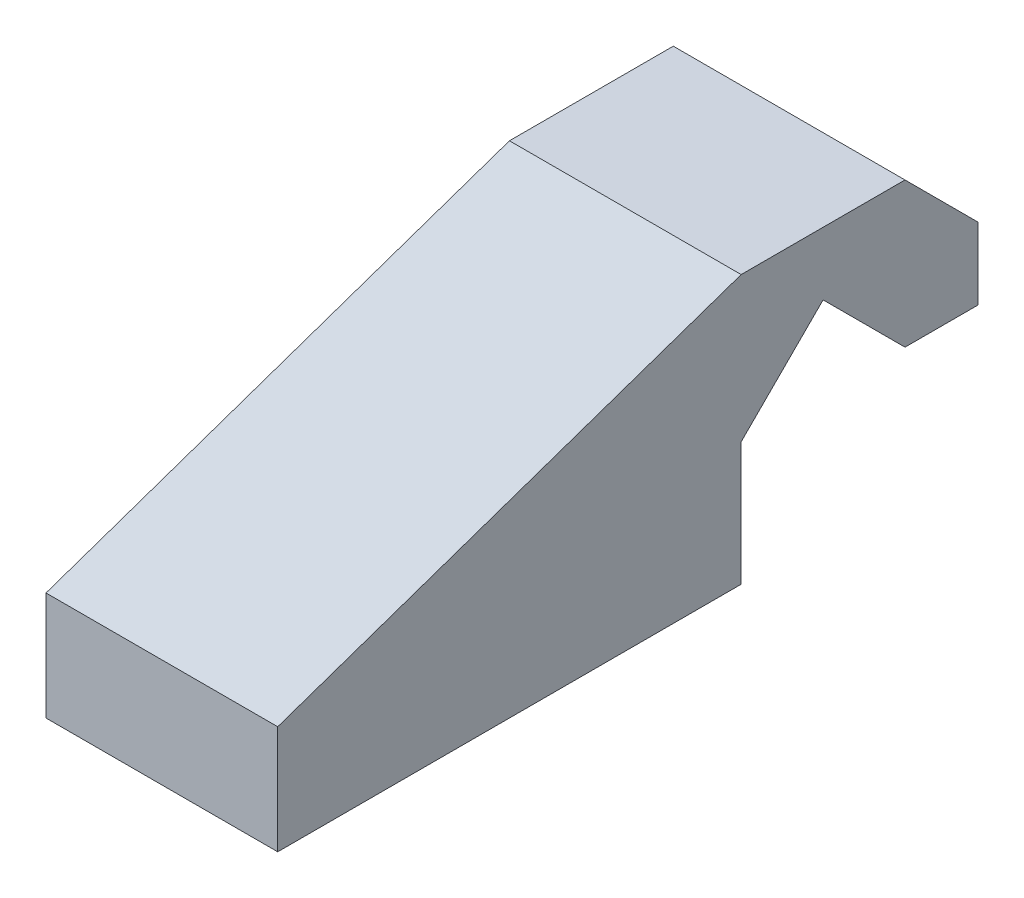
ISO-10303-21;
HEADER;
FILE_DESCRIPTION(('STEP AP214'),'2;1');
FILE_NAME('part.step','',(''),(''),'','','');
FILE_SCHEMA(('AUTOMOTIVE_DESIGN { 1 0 10303 214 1 1 1 1 }'));
ENDSEC;
DATA;
#1=APPLICATION_CONTEXT('core data for automotive mechanical design processes');
#2=APPLICATION_PROTOCOL_DEFINITION('international standard','automotive_design',2000,#1);
#3=PRODUCT_CONTEXT('',#1,'mechanical');
#4=PRODUCT('Part','Part','',(#3));
#5=PRODUCT_RELATED_PRODUCT_CATEGORY('part','',(#4));
#6=PRODUCT_DEFINITION_FORMATION('','',#4);
#7=PRODUCT_DEFINITION_CONTEXT('part definition',#1,'design');
#8=PRODUCT_DEFINITION('design','',#6,#7);
#9=PRODUCT_DEFINITION_SHAPE('','',#8);
#10=(LENGTH_UNIT() NAMED_UNIT(*) SI_UNIT(.MILLI.,.METRE.));
#11=(NAMED_UNIT(*) PLANE_ANGLE_UNIT() SI_UNIT($,.RADIAN.));
#12=(NAMED_UNIT(*) SI_UNIT($,.STERADIAN.) SOLID_ANGLE_UNIT());
#13=UNCERTAINTY_MEASURE_WITH_UNIT(LENGTH_MEASURE(1.E-05),#10,'distance_accuracy_value','');
#14=(GEOMETRIC_REPRESENTATION_CONTEXT(3) GLOBAL_UNCERTAINTY_ASSIGNED_CONTEXT((#13)) GLOBAL_UNIT_ASSIGNED_CONTEXT((#10,
#11,#12)) REPRESENTATION_CONTEXT('',''));
#15=CARTESIAN_POINT('',(0.,0.,0.));
#16=DIRECTION('',(0.,0.,1.));
#17=DIRECTION('',(1.,0.,0.));
#18=AXIS2_PLACEMENT_3D('',#15,#16,#17);
#19=CARTESIAN_POINT('',(-34.925,7.80131403026729,-1.26536368728356E-13));
#20=DIRECTION('',(0.,0.707106781186549,0.707106781186546));
#21=DIRECTION('',(0.,0.707106781186546,-0.707106781186549));
#22=AXIS2_PLACEMENT_3D('',#19,#20,#21);
#23=PLANE('',#22);
#24=DIRECTION('',(0.,-0.707106781186546,0.707106781186549));
#25=VECTOR('',#24,1.);
#26=CARTESIAN_POINT('',(-28.575,7.80131403026729,-1.04365462226702E-13));
#27=LINE('',#26,#25);
#28=CARTESIAN_POINT('',(-28.575,7.80131403026729,-1.04365462226702E-13));
#29=VERTEX_POINT('',#28);
#30=CARTESIAN_POINT('',(-28.575,5.55625,2.24506403026719));
#31=VERTEX_POINT('',#30);
#32=EDGE_CURVE('E140',#29,#31,#27,.T.);
#33=ORIENTED_EDGE('',*,*,#32,.T.);
#34=DIRECTION('',(1.,0.,0.));
#35=VECTOR('',#34,1.);
#36=CARTESIAN_POINT('',(-34.925,5.55625,2.24506403026717));
#37=LINE('',#36,#35);
#38=CARTESIAN_POINT('',(-34.925,5.55625,2.24506403026717));
#39=VERTEX_POINT('',#38);
#40=EDGE_CURVE('E11',#39,#31,#37,.T.);
#41=ORIENTED_EDGE('',*,*,#40,.F.);
#42=DIRECTION('',(0.,-0.707106781186546,0.707106781186549));
#43=VECTOR('',#42,1.);
#44=CARTESIAN_POINT('',(-34.925,7.80131403026729,-1.26536368728356E-13));
#45=LINE('',#44,#43);
#46=CARTESIAN_POINT('',(-34.925,7.80131403026729,-1.26536368728356E-13));
#47=VERTEX_POINT('',#46);
#48=EDGE_CURVE('E163',#47,#39,#45,.T.);
#49=ORIENTED_EDGE('',*,*,#48,.F.);
#50=DIRECTION('',(1.,0.,0.));
#51=VECTOR('',#50,1.);
#52=CARTESIAN_POINT('',(-34.925,7.80131403026729,-1.26536368728356E-13));
#53=LINE('',#52,#51);
#54=EDGE_CURVE('E136',#47,#29,#53,.T.);
#55=ORIENTED_EDGE('',*,*,#54,.T.);
#56=EDGE_LOOP('',(#33,#41,#49,#55));
#57=FACE_BOUND('',#56,.T.);
#58=ADVANCED_FACE('F33',(#57),#23,.F.);
#59=CARTESIAN_POINT('',(-34.925,3.175,2.24506403026717));
#60=DIRECTION('',(0.,0.,1.));
#61=DIRECTION('',(1.,0.,0.));
#62=AXIS2_PLACEMENT_3D('',#59,#60,#61);
#63=PLANE('',#62);
#64=DIRECTION('',(0.,-1.,0.));
#65=VECTOR('',#64,1.);
#66=CARTESIAN_POINT('',(-28.575,3.175,2.24506403026719));
#67=LINE('',#66,#65);
#68=CARTESIAN_POINT('',(-28.575,2.175,2.24506403026719));
#69=VERTEX_POINT('',#68);
#70=EDGE_CURVE('E143',#31,#69,#67,.T.);
#71=ORIENTED_EDGE('',*,*,#70,.T.);
#72=DIRECTION('',(1.,0.,0.));
#73=VECTOR('',#72,1.);
#74=CARTESIAN_POINT('',(-34.925,2.175,2.24506403026717));
#75=LINE('',#74,#73);
#76=CARTESIAN_POINT('',(-34.925,2.175,2.24506403026717));
#77=VERTEX_POINT('',#76);
#78=EDGE_CURVE('E41',#77,#69,#75,.T.);
#79=ORIENTED_EDGE('',*,*,#78,.F.);
#80=DIRECTION('',(0.,-1.,0.));
#81=VECTOR('',#80,1.);
#82=CARTESIAN_POINT('',(-34.925,5.55625,2.24506403026717));
#83=LINE('',#82,#81);
#84=EDGE_CURVE('E94',#39,#77,#83,.T.);
#85=ORIENTED_EDGE('',*,*,#84,.F.);
#86=ORIENTED_EDGE('',*,*,#40,.T.);
#87=EDGE_LOOP('',(#71,#79,#85,#86));
#88=FACE_BOUND('',#87,.T.);
#89=ADVANCED_FACE('F220',(#88),#63,.F.);
#90=CARTESIAN_POINT('',(-34.925,2.175,2.24506403026717));
#91=DIRECTION('',(0.,1.,0.));
#92=DIRECTION('',(-1.,0.,0.));
#93=AXIS2_PLACEMENT_3D('',#90,#91,#92);
#94=PLANE('',#93);
#95=DIRECTION('',(0.,0.,1.));
#96=VECTOR('',#95,1.);
#97=CARTESIAN_POINT('',(-28.575,2.175,2.24506403026719));
#98=LINE('',#97,#96);
#99=CARTESIAN_POINT('',(-28.5750000000001,2.175,14.9450640302672));
#100=VERTEX_POINT('',#99);
#101=EDGE_CURVE('E145',#69,#100,#98,.T.);
#102=ORIENTED_EDGE('',*,*,#101,.T.);
#103=DIRECTION('',(1.,0.,0.));
#104=VECTOR('',#103,1.);
#105=CARTESIAN_POINT('',(-34.9250000000001,2.175,14.9450640302672));
#106=LINE('',#105,#104);
#107=CARTESIAN_POINT('',(-34.9250000000001,2.175,14.9450640302672));
#108=VERTEX_POINT('',#107);
#109=EDGE_CURVE('E173',#108,#100,#106,.T.);
#110=ORIENTED_EDGE('',*,*,#109,.F.);
#111=DIRECTION('',(0.,0.,1.));
#112=VECTOR('',#111,1.);
#113=CARTESIAN_POINT('',(-34.925,2.175,2.24506403026717));
#114=LINE('',#113,#112);
#115=EDGE_CURVE('E181',#77,#108,#114,.T.);
#116=ORIENTED_EDGE('',*,*,#115,.F.);
#117=ORIENTED_EDGE('',*,*,#78,.T.);
#118=EDGE_LOOP('',(#102,#110,#116,#117));
#119=FACE_BOUND('',#118,.T.);
#120=ADVANCED_FACE('F179',(#119),#94,.F.);
#121=CARTESIAN_POINT('',(-34.9250000000001,5.14374999999999,14.9450640302672));
#122=DIRECTION('',(0.,0.,1.));
#123=DIRECTION('',(1.,0.,0.));
#124=AXIS2_PLACEMENT_3D('',#121,#122,#123);
#125=PLANE('',#124);
#126=DIRECTION('',(0.,-1.,0.));
#127=VECTOR('',#126,1.);
#128=CARTESIAN_POINT('',(-28.5750000000001,5.14374999999999,14.9450640302672));
#129=LINE('',#128,#127);
#130=CARTESIAN_POINT('',(-28.5750000000001,5.14374999999999,14.9450640302672));
#131=VERTEX_POINT('',#130);
#132=EDGE_CURVE('E148',#131,#100,#129,.T.);
#133=ORIENTED_EDGE('',*,*,#132,.F.);
#134=DIRECTION('',(1.,0.,0.));
#135=VECTOR('',#134,1.);
#136=CARTESIAN_POINT('',(-34.9250000000001,5.14374999999999,14.9450640302672));
#137=LINE('',#136,#135);
#138=CARTESIAN_POINT('',(-34.9250000000001,5.14374999999999,14.9450640302672));
#139=VERTEX_POINT('',#138);
#140=EDGE_CURVE('E171',#139,#131,#137,.T.);
#141=ORIENTED_EDGE('',*,*,#140,.F.);
#142=DIRECTION('',(0.,1.,0.));
#143=VECTOR('',#142,1.);
#144=CARTESIAN_POINT('',(-34.9250000000001,2.175,14.9450640302672));
#145=LINE('',#144,#143);
#146=EDGE_CURVE('E192',#108,#139,#145,.T.);
#147=ORIENTED_EDGE('',*,*,#146,.F.);
#148=ORIENTED_EDGE('',*,*,#109,.T.);
#149=EDGE_LOOP('',(#133,#141,#147,#148));
#150=FACE_BOUND('',#149,.T.);
#151=ADVANCED_FACE('F189',(#150),#125,.T.);
#152=CARTESIAN_POINT('',(-34.925,9.525,2.24506403026717));
#153=DIRECTION('',(0.,0.945328477747124,0.326119715994456));
#154=DIRECTION('',(0.,0.326119715994456,-0.945328477747124));
#155=AXIS2_PLACEMENT_3D('',#152,#153,#154);
#156=PLANE('',#155);
#157=DIRECTION('',(0.,-0.326119715994456,0.945328477747124));
#158=VECTOR('',#157,1.);
#159=CARTESIAN_POINT('',(-28.575,9.525,2.24506403026719));
#160=LINE('',#159,#158);
#161=CARTESIAN_POINT('',(-28.575,9.525,2.24506403026719));
#162=VERTEX_POINT('',#161);
#163=EDGE_CURVE('E150',#162,#131,#160,.T.);
#164=ORIENTED_EDGE('',*,*,#163,.F.);
#165=DIRECTION('',(1.,0.,0.));
#166=VECTOR('',#165,1.);
#167=CARTESIAN_POINT('',(-34.925,9.525,2.24506403026717));
#168=LINE('',#167,#166);
#169=CARTESIAN_POINT('',(-34.925,9.525,2.24506403026717));
#170=VERTEX_POINT('',#169);
#171=EDGE_CURVE('E169',#170,#162,#168,.T.);
#172=ORIENTED_EDGE('',*,*,#171,.F.);
#173=DIRECTION('',(0.,-0.326119715994456,0.945328477747124));
#174=VECTOR('',#173,1.);
#175=CARTESIAN_POINT('',(-34.925,9.525,2.24506403026717));
#176=LINE('',#175,#174);
#177=EDGE_CURVE('E194',#170,#139,#176,.T.);
#178=ORIENTED_EDGE('',*,*,#177,.T.);
#179=ORIENTED_EDGE('',*,*,#140,.T.);
#180=EDGE_LOOP('',(#164,#172,#178,#179));
#181=FACE_BOUND('',#180,.T.);
#182=ADVANCED_FACE('F231',(#181),#156,.T.);
#183=CARTESIAN_POINT('',(-34.925,9.525,-2.24506403026741));
#184=DIRECTION('',(0.,1.,0.));
#185=DIRECTION('',(-1.,0.,0.));
#186=AXIS2_PLACEMENT_3D('',#183,#184,#185);
#187=PLANE('',#186);
#188=DIRECTION('',(0.,0.,1.));
#189=VECTOR('',#188,1.);
#190=CARTESIAN_POINT('',(-28.575,9.525,-2.24506403026738));
#191=LINE('',#190,#189);
#192=CARTESIAN_POINT('',(-28.575,9.525,-2.24506403026738));
#193=VERTEX_POINT('',#192);
#194=EDGE_CURVE('E153',#193,#162,#191,.T.);
#195=ORIENTED_EDGE('',*,*,#194,.F.);
#196=DIRECTION('',(1.,0.,0.));
#197=VECTOR('',#196,1.);
#198=CARTESIAN_POINT('',(-34.925,9.525,-2.24506403026741));
#199=LINE('',#198,#197);
#200=CARTESIAN_POINT('',(-34.925,9.525,-2.24506403026741));
#201=VERTEX_POINT('',#200);
#202=EDGE_CURVE('E167',#201,#193,#199,.T.);
#203=ORIENTED_EDGE('',*,*,#202,.F.);
#204=DIRECTION('',(0.,0.,1.));
#205=VECTOR('',#204,1.);
#206=CARTESIAN_POINT('',(-34.925,9.525,-2.24506403026741));
#207=LINE('',#206,#205);
#208=EDGE_CURVE('E196',#201,#170,#207,.T.);
#209=ORIENTED_EDGE('',*,*,#208,.T.);
#210=ORIENTED_EDGE('',*,*,#171,.T.);
#211=EDGE_LOOP('',(#195,#203,#209,#210));
#212=FACE_BOUND('',#211,.T.);
#213=ADVANCED_FACE('F234',(#212),#187,.T.);
#214=CARTESIAN_POINT('',(-34.925,7.52499999999999,-4.24506403026741));
#215=DIRECTION('',(0.,0.707106781186546,-0.707106781186549));
#216=DIRECTION('',(0.,-0.707106781186549,-0.707106781186546));
#217=AXIS2_PLACEMENT_3D('',#214,#215,#216);
#218=PLANE('',#217);
#219=DIRECTION('',(0.,0.707106781186549,0.707106781186546));
#220=VECTOR('',#219,1.);
#221=CARTESIAN_POINT('',(-28.575,7.52499999999999,-4.24506403026738));
#222=LINE('',#221,#220);
#223=CARTESIAN_POINT('',(-28.575,7.52499999999999,-4.24506403026738));
#224=VERTEX_POINT('',#223);
#225=EDGE_CURVE('E156',#224,#193,#222,.T.);
#226=ORIENTED_EDGE('',*,*,#225,.F.);
#227=DIRECTION('',(1.,0.,0.));
#228=VECTOR('',#227,1.);
#229=CARTESIAN_POINT('',(-34.925,7.52499999999999,-4.24506403026741));
#230=LINE('',#229,#228);
#231=CARTESIAN_POINT('',(-34.925,7.52499999999999,-4.24506403026741));
#232=VERTEX_POINT('',#231);
#233=EDGE_CURVE('E125',#232,#224,#230,.T.);
#234=ORIENTED_EDGE('',*,*,#233,.F.);
#235=DIRECTION('',(0.,0.707106781186549,0.707106781186546));
#236=VECTOR('',#235,1.);
#237=CARTESIAN_POINT('',(-34.925,7.52499999999999,-4.24506403026741));
#238=LINE('',#237,#236);
#239=EDGE_CURVE('E132',#232,#201,#238,.T.);
#240=ORIENTED_EDGE('',*,*,#239,.T.);
#241=ORIENTED_EDGE('',*,*,#202,.T.);
#242=EDGE_LOOP('',(#226,#234,#240,#241));
#243=FACE_BOUND('',#242,.T.);
#244=ADVANCED_FACE('F204',(#243),#218,.T.);
#245=CARTESIAN_POINT('',(-34.925,5.55625,-4.24506403026741));
#246=DIRECTION('',(0.,0.,-1.));
#247=DIRECTION('',(-1.,0.,0.));
#248=AXIS2_PLACEMENT_3D('',#245,#246,#247);
#249=PLANE('',#248);
#250=DIRECTION('',(0.,1.,0.));
#251=VECTOR('',#250,1.);
#252=CARTESIAN_POINT('',(-28.575,5.55625,-4.24506403026738));
#253=LINE('',#252,#251);
#254=CARTESIAN_POINT('',(-28.575,5.55625,-4.24506403026738));
#255=VERTEX_POINT('',#254);
#256=EDGE_CURVE('E120',#255,#224,#253,.T.);
#257=ORIENTED_EDGE('',*,*,#256,.F.);
#258=DIRECTION('',(1.,0.,0.));
#259=VECTOR('',#258,1.);
#260=CARTESIAN_POINT('',(-34.925,5.55625,-4.24506403026741));
#261=LINE('',#260,#259);
#262=CARTESIAN_POINT('',(-34.925,5.55625,-4.24506403026741));
#263=VERTEX_POINT('',#262);
#264=EDGE_CURVE('E115',#263,#255,#261,.T.);
#265=ORIENTED_EDGE('',*,*,#264,.F.);
#266=DIRECTION('',(0.,1.,0.));
#267=VECTOR('',#266,1.);
#268=CARTESIAN_POINT('',(-34.925,5.55625,-4.24506403026741));
#269=LINE('',#268,#267);
#270=EDGE_CURVE('E118',#263,#232,#269,.T.);
#271=ORIENTED_EDGE('',*,*,#270,.T.);
#272=ORIENTED_EDGE('',*,*,#233,.T.);
#273=EDGE_LOOP('',(#257,#265,#271,#272));
#274=FACE_BOUND('',#273,.T.);
#275=ADVANCED_FACE('F117',(#274),#249,.T.);
#276=CARTESIAN_POINT('',(-34.925,5.55625,-2.24506403026741));
#277=DIRECTION('',(0.,-1.,0.));
#278=DIRECTION('',(0.,0.,1.));
#279=AXIS2_PLACEMENT_3D('',#276,#277,#278);
#280=PLANE('',#279);
#281=DIRECTION('',(0.,0.,-1.));
#282=VECTOR('',#281,1.);
#283=CARTESIAN_POINT('',(-28.575,5.55625,-2.24506403026738));
#284=LINE('',#283,#282);
#285=CARTESIAN_POINT('',(-28.575,5.55625,-2.24506403026738));
#286=VERTEX_POINT('',#285);
#287=EDGE_CURVE('E160',#286,#255,#284,.T.);
#288=ORIENTED_EDGE('',*,*,#287,.F.);
#289=DIRECTION('',(1.,0.,0.));
#290=VECTOR('',#289,1.);
#291=CARTESIAN_POINT('',(-34.925,5.55625,-2.24506403026741));
#292=LINE('',#291,#290);
#293=CARTESIAN_POINT('',(-34.925,5.55625,-2.24506403026741));
#294=VERTEX_POINT('',#293);
#295=EDGE_CURVE('E83',#294,#286,#292,.T.);
#296=ORIENTED_EDGE('',*,*,#295,.F.);
#297=DIRECTION('',(0.,0.,-1.));
#298=VECTOR('',#297,1.);
#299=CARTESIAN_POINT('',(-34.925,5.55625,-2.24506403026741));
#300=LINE('',#299,#298);
#301=EDGE_CURVE('E129',#294,#263,#300,.T.);
#302=ORIENTED_EDGE('',*,*,#301,.T.);
#303=ORIENTED_EDGE('',*,*,#264,.T.);
#304=EDGE_LOOP('',(#288,#296,#302,#303));
#305=FACE_BOUND('',#304,.T.);
#306=ADVANCED_FACE('F134',(#305),#280,.T.);
#307=CARTESIAN_POINT('',(-34.925,5.55625,-2.24506403026741));
#308=DIRECTION('',(0.,0.707106781186546,-0.707106781186549));
#309=DIRECTION('',(0.,-0.707106781186549,-0.707106781186546));
#310=AXIS2_PLACEMENT_3D('',#307,#308,#309);
#311=PLANE('',#310);
#312=DIRECTION('',(0.,0.707106781186549,0.707106781186546));
#313=VECTOR('',#312,1.);
#314=CARTESIAN_POINT('',(-28.575,5.55625,-2.24506403026738));
#315=LINE('',#314,#313);
#316=EDGE_CURVE('E86',#286,#29,#315,.T.);
#317=ORIENTED_EDGE('',*,*,#316,.T.);
#318=ORIENTED_EDGE('',*,*,#54,.F.);
#319=DIRECTION('',(0.,0.707106781186549,0.707106781186546));
#320=VECTOR('',#319,1.);
#321=CARTESIAN_POINT('',(-34.925,5.55625,-2.24506403026741));
#322=LINE('',#321,#320);
#323=EDGE_CURVE('E49',#294,#47,#322,.T.);
#324=ORIENTED_EDGE('',*,*,#323,.F.);
#325=ORIENTED_EDGE('',*,*,#295,.T.);
#326=EDGE_LOOP('',(#317,#318,#324,#325));
#327=FACE_BOUND('',#326,.T.);
#328=ADVANCED_FACE('F209',(#327),#311,.F.);
#329=CARTESIAN_POINT('',(-34.925,0.,-1.21939985759096E-13));
#330=DIRECTION('',(-1.,0.,0.));
#331=DIRECTION('',(0.,0.,1.));
#332=AXIS2_PLACEMENT_3D('',#329,#330,#331);
#333=PLANE('',#332);
#334=ORIENTED_EDGE('',*,*,#48,.T.);
#335=ORIENTED_EDGE('',*,*,#84,.T.);
#336=ORIENTED_EDGE('',*,*,#115,.T.);
#337=ORIENTED_EDGE('',*,*,#146,.T.);
#338=ORIENTED_EDGE('',*,*,#177,.F.);
#339=ORIENTED_EDGE('',*,*,#208,.F.);
#340=ORIENTED_EDGE('',*,*,#239,.F.);
#341=ORIENTED_EDGE('',*,*,#270,.F.);
#342=ORIENTED_EDGE('',*,*,#301,.F.);
#343=ORIENTED_EDGE('',*,*,#323,.T.);
#344=EDGE_LOOP('',(#334,#335,#336,#337,#338,#339,#340,#341,#342,#343));
#345=FACE_BOUND('',#344,.T.);
#346=ADVANCED_FACE('F128',(#345),#333,.T.);
#347=CARTESIAN_POINT('',(-28.575,0.,0.));
#348=DIRECTION('',(-1.,0.,0.));
#349=DIRECTION('',(0.,0.,1.));
#350=AXIS2_PLACEMENT_3D('',#347,#348,#349);
#351=PLANE('',#350);
#352=ORIENTED_EDGE('',*,*,#32,.F.);
#353=ORIENTED_EDGE('',*,*,#316,.F.);
#354=ORIENTED_EDGE('',*,*,#287,.T.);
#355=ORIENTED_EDGE('',*,*,#256,.T.);
#356=ORIENTED_EDGE('',*,*,#225,.T.);
#357=ORIENTED_EDGE('',*,*,#194,.T.);
#358=ORIENTED_EDGE('',*,*,#163,.T.);
#359=ORIENTED_EDGE('',*,*,#132,.T.);
#360=ORIENTED_EDGE('',*,*,#101,.F.);
#361=ORIENTED_EDGE('',*,*,#70,.F.);
#362=EDGE_LOOP('',(#352,#353,#354,#355,#356,#357,#358,#359,#360,#361));
#363=FACE_BOUND('',#362,.T.);
#364=ADVANCED_FACE('F184',(#363),#351,.F.);
#365=CLOSED_SHELL('',(#58,#89,#120,#151,#182,#213,#244,#275,#306,#328,#346,#364));
#366=MANIFOLD_SOLID_BREP('B2',#365);
#367=ADVANCED_BREP_SHAPE_REPRESENTATION('',(#18,#366),#14);
#368=SHAPE_DEFINITION_REPRESENTATION(#9,#367);
ENDSEC;
END-ISO-10303-21;
